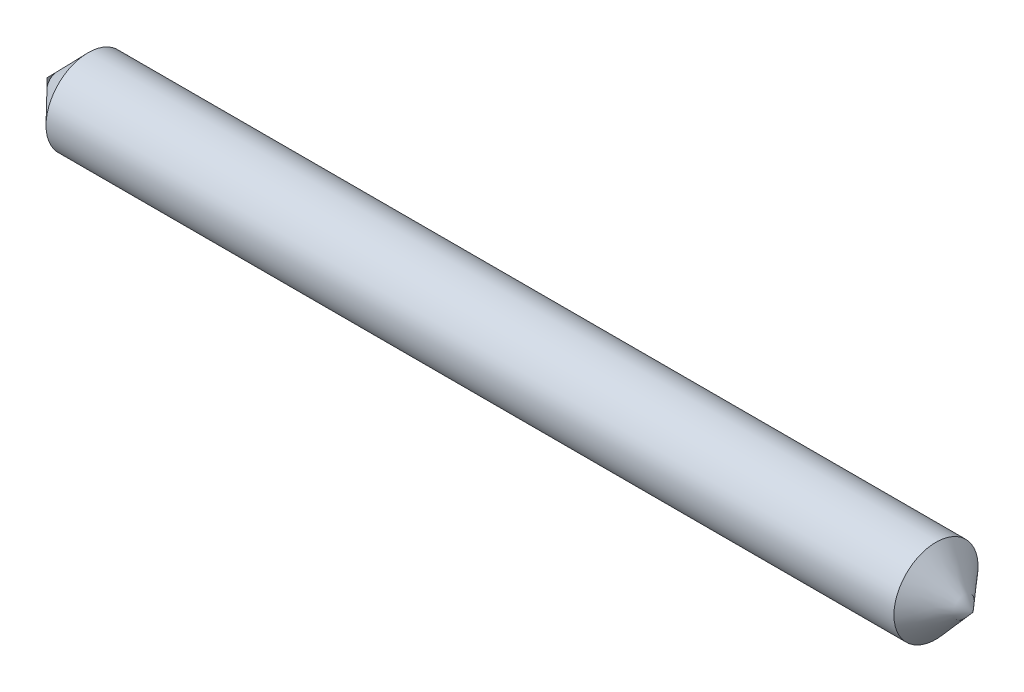
ISO-10303-21;
HEADER;
FILE_DESCRIPTION(('STEP AP214'),'2;1');
FILE_NAME('part.step','',(''),(''),'','','');
FILE_SCHEMA(('AUTOMOTIVE_DESIGN { 1 0 10303 214 1 1 1 1 }'));
ENDSEC;
DATA;
#1=APPLICATION_CONTEXT('core data for automotive mechanical design processes');
#2=APPLICATION_PROTOCOL_DEFINITION('international standard','automotive_design',2000,#1);
#3=PRODUCT_CONTEXT('',#1,'mechanical');
#4=PRODUCT('Part','Part','',(#3));
#5=PRODUCT_RELATED_PRODUCT_CATEGORY('part','',(#4));
#6=PRODUCT_DEFINITION_FORMATION('','',#4);
#7=PRODUCT_DEFINITION_CONTEXT('part definition',#1,'design');
#8=PRODUCT_DEFINITION('design','',#6,#7);
#9=PRODUCT_DEFINITION_SHAPE('','',#8);
#10=(LENGTH_UNIT() NAMED_UNIT(*) SI_UNIT(.MILLI.,.METRE.));
#11=(NAMED_UNIT(*) PLANE_ANGLE_UNIT() SI_UNIT($,.RADIAN.));
#12=(NAMED_UNIT(*) SI_UNIT($,.STERADIAN.) SOLID_ANGLE_UNIT());
#13=UNCERTAINTY_MEASURE_WITH_UNIT(LENGTH_MEASURE(1.E-05),#10,'distance_accuracy_value','');
#14=(GEOMETRIC_REPRESENTATION_CONTEXT(3) GLOBAL_UNCERTAINTY_ASSIGNED_CONTEXT((#13)) GLOBAL_UNIT_ASSIGNED_CONTEXT((#10,
#11,#12)) REPRESENTATION_CONTEXT('',''));
#15=CARTESIAN_POINT('',(0.,0.,0.));
#16=DIRECTION('',(0.,0.,1.));
#17=DIRECTION('',(1.,0.,0.));
#18=AXIS2_PLACEMENT_3D('',#15,#16,#17);
#19=CARTESIAN_POINT('',(-61.4092595220045,7.18483976992605,0.));
#20=DIRECTION('',(1.,0.,0.));
#21=DIRECTION('',(0.,0.,-1.));
#22=AXIS2_PLACEMENT_3D('',#19,#20,#21);
#23=CONICAL_SURFACE('',#22,18.178462804953,0.800319841448886);
#24=CARTESIAN_POINT('',(-79.0531529840006,7.18483976992605,0.));
#25=VERTEX_POINT('',#24);
#26=VERTEX_LOOP('',#25);
#27=FACE_BOUND('',#26,.T.);
#28=CARTESIAN_POINT('',(-61.4092595220045,7.18483976992605,0.));
#29=DIRECTION('',(-1.,0.,0.));
#30=DIRECTION('',(0.,0.,1.));
#31=AXIS2_PLACEMENT_3D('',#28,#29,#30);
#32=CIRCLE('',#31,18.178462804953);
#33=CARTESIAN_POINT('',(-61.4092595220045,7.18483976992605,18.178462804953));
#34=VERTEX_POINT('',#33);
#35=EDGE_CURVE('E11',#34,#34,#32,.T.);
#36=ORIENTED_EDGE('',*,*,#35,.T.);
#37=EDGE_LOOP('',(#36));
#38=FACE_BOUND('',#37,.T.);
#39=ADVANCED_FACE('F35',(#27,#38),#23,.T.);
#40=CARTESIAN_POINT('',(-79.0531529840006,7.18483976992605,0.));
#41=DIRECTION('',(-1.,0.,0.));
#42=DIRECTION('',(0.,0.,1.));
#43=AXIS2_PLACEMENT_3D('',#40,#41,#42);
#44=CYLINDRICAL_SURFACE('',#43,18.178462804953);
#45=ORIENTED_EDGE('',*,*,#35,.F.);
#46=EDGE_LOOP('',(#45));
#47=FACE_BOUND('',#46,.T.);
#48=CARTESIAN_POINT('',(304.924926315513,7.18483976992605,0.));
#49=DIRECTION('',(-1.,0.,0.));
#50=DIRECTION('',(0.,0.,1.));
#51=AXIS2_PLACEMENT_3D('',#48,#49,#50);
#52=CIRCLE('',#51,18.178462804953);
#53=CARTESIAN_POINT('',(304.924926315513,7.18483976992605,18.178462804953));
#54=VERTEX_POINT('',#53);
#55=EDGE_CURVE('E42',#54,#54,#52,.T.);
#56=ORIENTED_EDGE('',*,*,#55,.T.);
#57=EDGE_LOOP('',(#56));
#58=FACE_BOUND('',#57,.T.);
#59=ADVANCED_FACE('F50',(#47,#58),#44,.T.);
#60=CARTESIAN_POINT('',(320.946847015999,7.18483976992605,0.));
#61=DIRECTION('',(-1.,0.,0.));
#62=DIRECTION('',(0.,0.,1.));
#63=AXIS2_PLACEMENT_3D('',#60,#61,#62);
#64=CONICAL_SURFACE('',#63,0.,0.848370870021235);
#65=ORIENTED_EDGE('',*,*,#55,.F.);
#66=EDGE_LOOP('',(#65));
#67=FACE_BOUND('',#66,.T.);
#68=CARTESIAN_POINT('',(320.946847015999,7.18483976992605,0.));
#69=VERTEX_POINT('',#68);
#70=VERTEX_LOOP('',#69);
#71=FACE_BOUND('',#70,.T.);
#72=ADVANCED_FACE('F55',(#67,#71),#64,.T.);
#73=CLOSED_SHELL('',(#39,#59,#72));
#74=MANIFOLD_SOLID_BREP('B2',#73);
#75=ADVANCED_BREP_SHAPE_REPRESENTATION('',(#18,#74),#14);
#76=SHAPE_DEFINITION_REPRESENTATION(#9,#75);
ENDSEC;
END-ISO-10303-21;
